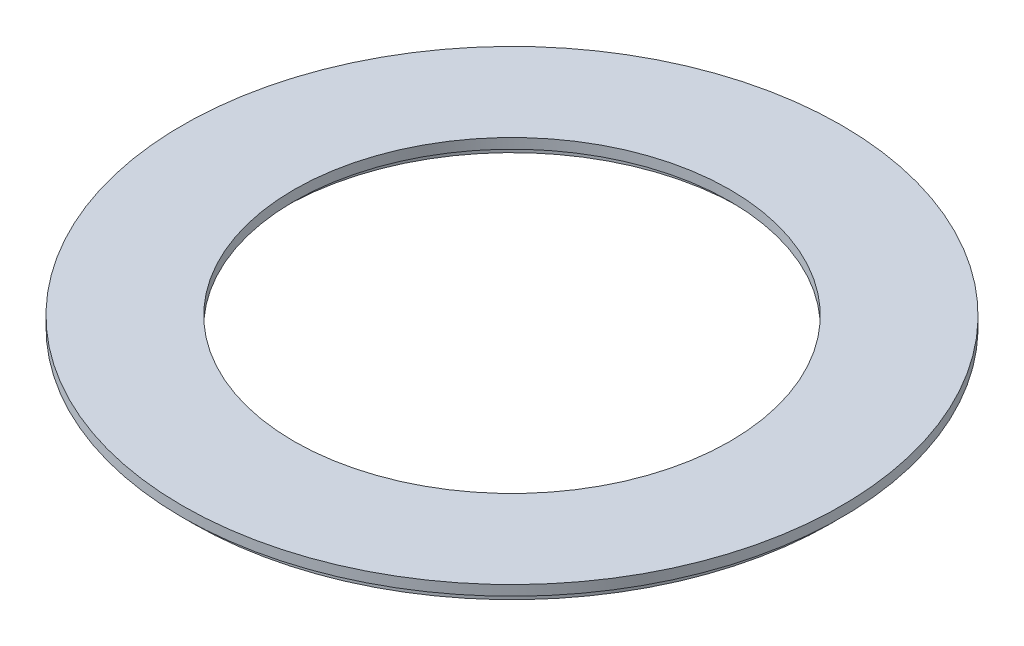
ISO-10303-21;
HEADER;
FILE_DESCRIPTION(('STEP AP214'),'2;1');
FILE_NAME('part.step','',(''),(''),'','','');
FILE_SCHEMA(('AUTOMOTIVE_DESIGN { 1 0 10303 214 1 1 1 1 }'));
ENDSEC;
DATA;
#1=APPLICATION_CONTEXT('core data for automotive mechanical design processes');
#2=APPLICATION_PROTOCOL_DEFINITION('international standard','automotive_design',2000,#1);
#3=PRODUCT_CONTEXT('',#1,'mechanical');
#4=PRODUCT('Part','Part','',(#3));
#5=PRODUCT_RELATED_PRODUCT_CATEGORY('part','',(#4));
#6=PRODUCT_DEFINITION_FORMATION('','',#4);
#7=PRODUCT_DEFINITION_CONTEXT('part definition',#1,'design');
#8=PRODUCT_DEFINITION('design','',#6,#7);
#9=PRODUCT_DEFINITION_SHAPE('','',#8);
#10=(LENGTH_UNIT() NAMED_UNIT(*) SI_UNIT(.MILLI.,.METRE.));
#11=(NAMED_UNIT(*) PLANE_ANGLE_UNIT() SI_UNIT($,.RADIAN.));
#12=(NAMED_UNIT(*) SI_UNIT($,.STERADIAN.) SOLID_ANGLE_UNIT());
#13=UNCERTAINTY_MEASURE_WITH_UNIT(LENGTH_MEASURE(1.E-05),#10,'distance_accuracy_value','');
#14=(GEOMETRIC_REPRESENTATION_CONTEXT(3) GLOBAL_UNCERTAINTY_ASSIGNED_CONTEXT((#13)) GLOBAL_UNIT_ASSIGNED_CONTEXT((#10,
#11,#12)) REPRESENTATION_CONTEXT('',''));
#15=CARTESIAN_POINT('',(0.,0.,0.));
#16=DIRECTION('',(0.,0.,1.));
#17=DIRECTION('',(1.,0.,0.));
#18=AXIS2_PLACEMENT_3D('',#15,#16,#17);
#19=CARTESIAN_POINT('',(0.,0.,0.));
#20=DIRECTION('',(0.,1.,0.));
#21=DIRECTION('',(0.,0.,1.));
#22=AXIS2_PLACEMENT_3D('',#19,#20,#21);
#23=PLANE('',#22);
#24=CARTESIAN_POINT('',(0.,0.,0.));
#25=DIRECTION('',(0.,1.,0.));
#26=DIRECTION('',(0.,0.,1.));
#27=AXIS2_PLACEMENT_3D('',#24,#25,#26);
#28=CIRCLE('',#27,10.75);
#29=CARTESIAN_POINT('',(0.,0.,10.75));
#30=VERTEX_POINT('',#29);
#31=EDGE_CURVE('E49',#30,#30,#28,.T.);
#32=ORIENTED_EDGE('',*,*,#31,.T.);
#33=EDGE_LOOP('',(#32));
#34=FACE_BOUND('',#33,.T.);
#35=CARTESIAN_POINT('',(0.,0.,0.));
#36=DIRECTION('',(0.,-1.,0.));
#37=DIRECTION('',(0.,0.,-1.));
#38=AXIS2_PLACEMENT_3D('',#35,#36,#37);
#39=CIRCLE('',#38,11.25);
#40=CARTESIAN_POINT('',(0.,0.,-11.25));
#41=VERTEX_POINT('',#40);
#42=EDGE_CURVE('E58',#41,#41,#39,.T.);
#43=ORIENTED_EDGE('',*,*,#42,.T.);
#44=EDGE_LOOP('',(#43));
#45=FACE_BOUND('',#44,.T.);
#46=ADVANCED_FACE('F31',(#34,#45),#23,.F.);
#47=CARTESIAN_POINT('',(0.,0.5,0.));
#48=DIRECTION('',(0.,1.,0.));
#49=DIRECTION('',(0.,0.,1.));
#50=AXIS2_PLACEMENT_3D('',#47,#48,#49);
#51=PLANE('',#50);
#52=CARTESIAN_POINT('',(0.,0.5,0.));
#53=DIRECTION('',(0.,1.,0.));
#54=DIRECTION('',(0.,0.,1.));
#55=AXIS2_PLACEMENT_3D('',#52,#53,#54);
#56=CIRCLE('',#55,16.25);
#57=CARTESIAN_POINT('',(0.,0.5,16.25));
#58=VERTEX_POINT('',#57);
#59=EDGE_CURVE('E38',#58,#58,#56,.T.);
#60=ORIENTED_EDGE('',*,*,#59,.T.);
#61=EDGE_LOOP('',(#60));
#62=FACE_BOUND('',#61,.T.);
#63=CARTESIAN_POINT('',(0.,0.5,0.));
#64=DIRECTION('',(0.,1.,0.));
#65=DIRECTION('',(0.,0.,1.));
#66=AXIS2_PLACEMENT_3D('',#63,#64,#65);
#67=CIRCLE('',#66,10.75);
#68=CARTESIAN_POINT('',(0.,0.5,10.75));
#69=VERTEX_POINT('',#68);
#70=EDGE_CURVE('E47',#69,#69,#67,.T.);
#71=ORIENTED_EDGE('',*,*,#70,.F.);
#72=EDGE_LOOP('',(#71));
#73=FACE_BOUND('',#72,.T.);
#74=ADVANCED_FACE('F83',(#62,#73),#51,.T.);
#75=CARTESIAN_POINT('',(0.,0.,0.));
#76=DIRECTION('',(0.,1.,0.));
#77=DIRECTION('',(0.,0.,1.));
#78=AXIS2_PLACEMENT_3D('',#75,#76,#77);
#79=CIRCLE('',#78,15.75);
#80=CARTESIAN_POINT('',(0.,0.,15.75));
#81=VERTEX_POINT('',#80);
#82=EDGE_CURVE('E10',#81,#81,#79,.F.);
#83=ORIENTED_EDGE('',*,*,#82,.F.);
#84=EDGE_LOOP('',(#83));
#85=FACE_BOUND('',#84,.T.);
#86=CARTESIAN_POINT('',(0.,0.,0.));
#87=DIRECTION('',(0.,1.,0.));
#88=DIRECTION('',(0.,0.,1.));
#89=AXIS2_PLACEMENT_3D('',#86,#87,#88);
#90=CIRCLE('',#89,16.25);
#91=CARTESIAN_POINT('',(0.,0.,16.25));
#92=VERTEX_POINT('',#91);
#93=EDGE_CURVE('E42',#92,#92,#90,.T.);
#94=ORIENTED_EDGE('',*,*,#93,.F.);
#95=EDGE_LOOP('',(#94));
#96=FACE_BOUND('',#95,.T.);
#97=ADVANCED_FACE('F85',(#85,#96),#23,.F.);
#98=CARTESIAN_POINT('',(0.,0.5,0.));
#99=DIRECTION('',(0.,-1.,0.));
#100=DIRECTION('',(0.,0.,-1.));
#101=AXIS2_PLACEMENT_3D('',#98,#99,#100);
#102=CYLINDRICAL_SURFACE('',#101,16.25);
#103=ORIENTED_EDGE('',*,*,#59,.F.);
#104=EDGE_LOOP('',(#103));
#105=FACE_BOUND('',#104,.T.);
#106=ORIENTED_EDGE('',*,*,#93,.T.);
#107=EDGE_LOOP('',(#106));
#108=FACE_BOUND('',#107,.T.);
#109=ADVANCED_FACE('F33',(#105,#108),#102,.T.);
#110=CARTESIAN_POINT('',(0.,0.5,0.));
#111=DIRECTION('',(0.,-1.,0.));
#112=DIRECTION('',(0.,0.,-1.));
#113=AXIS2_PLACEMENT_3D('',#110,#111,#112);
#114=CYLINDRICAL_SURFACE('',#113,10.75);
#115=ORIENTED_EDGE('',*,*,#70,.T.);
#116=EDGE_LOOP('',(#115));
#117=FACE_BOUND('',#116,.T.);
#118=ORIENTED_EDGE('',*,*,#31,.F.);
#119=EDGE_LOOP('',(#118));
#120=FACE_BOUND('',#119,.T.);
#121=ADVANCED_FACE('F70',(#117,#120),#114,.F.);
#122=CARTESIAN_POINT('',(0.,-0.5,0.));
#123=DIRECTION('',(0.,-1.,0.));
#124=DIRECTION('',(0.,0.,-1.));
#125=AXIS2_PLACEMENT_3D('',#122,#123,#124);
#126=PLANE('',#125);
#127=CARTESIAN_POINT('',(0.,-0.5,0.));
#128=DIRECTION('',(0.,-1.,0.));
#129=DIRECTION('',(0.,0.,-1.));
#130=AXIS2_PLACEMENT_3D('',#127,#128,#129);
#131=CIRCLE('',#130,15.75);
#132=CARTESIAN_POINT('',(0.,-0.5,-15.75));
#133=VERTEX_POINT('',#132);
#134=EDGE_CURVE('E52',#133,#133,#131,.T.);
#135=ORIENTED_EDGE('',*,*,#134,.T.);
#136=EDGE_LOOP('',(#135));
#137=FACE_BOUND('',#136,.T.);
#138=CARTESIAN_POINT('',(0.,-0.5,0.));
#139=DIRECTION('',(0.,-1.,0.));
#140=DIRECTION('',(0.,0.,-1.));
#141=AXIS2_PLACEMENT_3D('',#138,#139,#140);
#142=CIRCLE('',#141,11.25);
#143=CARTESIAN_POINT('',(0.,-0.5,-11.25));
#144=VERTEX_POINT('',#143);
#145=EDGE_CURVE('E57',#144,#144,#142,.T.);
#146=ORIENTED_EDGE('',*,*,#145,.F.);
#147=EDGE_LOOP('',(#146));
#148=FACE_BOUND('',#147,.T.);
#149=ADVANCED_FACE('F67',(#137,#148),#126,.T.);
#150=CARTESIAN_POINT('',(0.,-0.5,0.));
#151=DIRECTION('',(0.,1.,0.));
#152=DIRECTION('',(0.,0.,1.));
#153=AXIS2_PLACEMENT_3D('',#150,#151,#152);
#154=CYLINDRICAL_SURFACE('',#153,15.75);
#155=ORIENTED_EDGE('',*,*,#134,.F.);
#156=EDGE_LOOP('',(#155));
#157=FACE_BOUND('',#156,.T.);
#158=ORIENTED_EDGE('',*,*,#82,.T.);
#159=EDGE_LOOP('',(#158));
#160=FACE_BOUND('',#159,.T.);
#161=ADVANCED_FACE('F69',(#157,#160),#154,.T.);
#162=CARTESIAN_POINT('',(0.,-0.5,0.));
#163=DIRECTION('',(0.,1.,0.));
#164=DIRECTION('',(0.,0.,1.));
#165=AXIS2_PLACEMENT_3D('',#162,#163,#164);
#166=CYLINDRICAL_SURFACE('',#165,11.25);
#167=ORIENTED_EDGE('',*,*,#145,.T.);
#168=EDGE_LOOP('',(#167));
#169=FACE_BOUND('',#168,.T.);
#170=ORIENTED_EDGE('',*,*,#42,.F.);
#171=EDGE_LOOP('',(#170));
#172=FACE_BOUND('',#171,.T.);
#173=ADVANCED_FACE('F64',(#169,#172),#166,.F.);
#174=CLOSED_SHELL('',(#46,#74,#97,#109,#121,#149,#161,#173));
#175=MANIFOLD_SOLID_BREP('B2',#174);
#176=ADVANCED_BREP_SHAPE_REPRESENTATION('',(#18,#175),#14);
#177=SHAPE_DEFINITION_REPRESENTATION(#9,#176);
ENDSEC;
END-ISO-10303-21;
